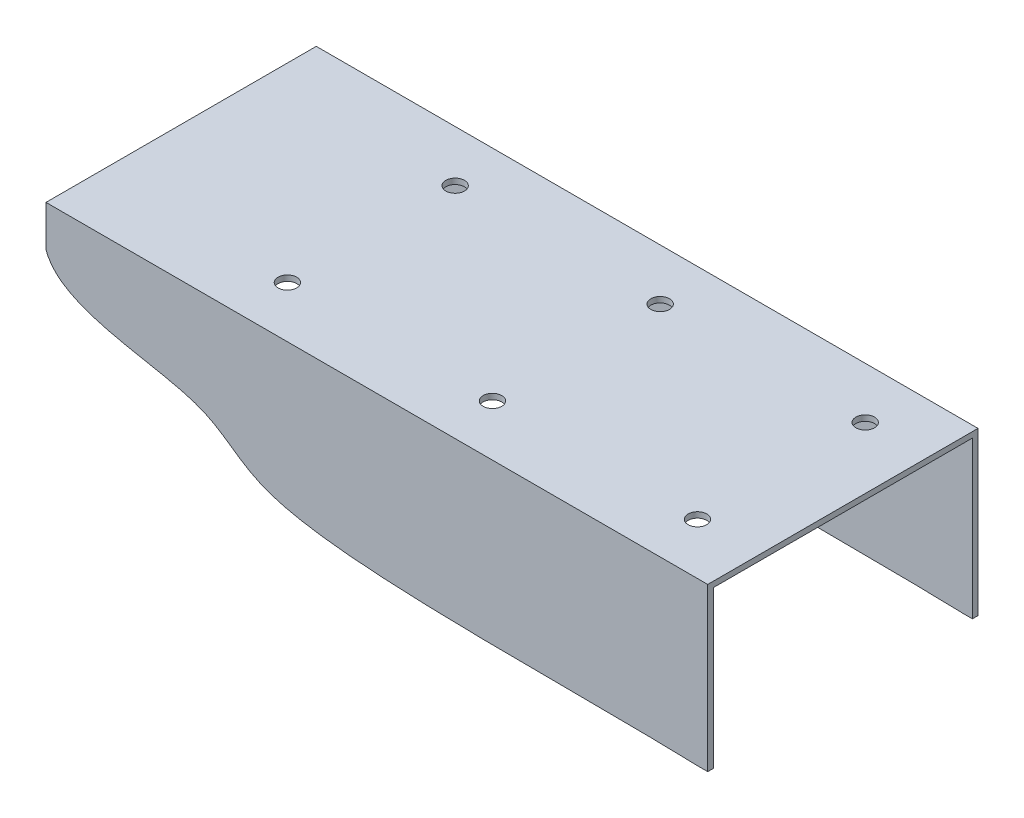
ISO-10303-21;
HEADER;
FILE_DESCRIPTION(('STEP AP214'),'2;1');
FILE_NAME('part.step','',(''),(''),'','','');
FILE_SCHEMA(('AUTOMOTIVE_DESIGN { 1 0 10303 214 1 1 1 1 }'));
ENDSEC;
DATA;
#1=APPLICATION_CONTEXT('core data for automotive mechanical design processes');
#2=APPLICATION_PROTOCOL_DEFINITION('international standard','automotive_design',2000,#1);
#3=PRODUCT_CONTEXT('',#1,'mechanical');
#4=PRODUCT('Part','Part','',(#3));
#5=PRODUCT_RELATED_PRODUCT_CATEGORY('part','',(#4));
#6=PRODUCT_DEFINITION_FORMATION('','',#4);
#7=PRODUCT_DEFINITION_CONTEXT('part definition',#1,'design');
#8=PRODUCT_DEFINITION('design','',#6,#7);
#9=PRODUCT_DEFINITION_SHAPE('','',#8);
#10=(LENGTH_UNIT() NAMED_UNIT(*) SI_UNIT(.MILLI.,.METRE.));
#11=(NAMED_UNIT(*) PLANE_ANGLE_UNIT() SI_UNIT($,.RADIAN.));
#12=(NAMED_UNIT(*) SI_UNIT($,.STERADIAN.) SOLID_ANGLE_UNIT());
#13=UNCERTAINTY_MEASURE_WITH_UNIT(LENGTH_MEASURE(1.E-05),#10,'distance_accuracy_value','');
#14=(GEOMETRIC_REPRESENTATION_CONTEXT(3) GLOBAL_UNCERTAINTY_ASSIGNED_CONTEXT((#13)) GLOBAL_UNIT_ASSIGNED_CONTEXT((#10,
#11,#12)) REPRESENTATION_CONTEXT('',''));
#15=CARTESIAN_POINT('',(0.,0.,0.));
#16=DIRECTION('',(0.,0.,1.));
#17=DIRECTION('',(1.,0.,0.));
#18=AXIS2_PLACEMENT_3D('',#15,#16,#17);
#19=CARTESIAN_POINT('',(355.,87.,-142.));
#20=DIRECTION('',(0.,0.,-1.));
#21=DIRECTION('',(0.,1.,0.));
#22=AXIS2_PLACEMENT_3D('',#19,#20,#21);
#23=PLANE('',#22);
#24=DIRECTION('',(0.,-1.,0.));
#25=VECTOR('',#24,1.);
#26=CARTESIAN_POINT('',(0.,87.,-142.));
#27=LINE('',#26,#25);
#28=CARTESIAN_POINT('',(0.,84.,-142.));
#29=VERTEX_POINT('',#28);
#30=CARTESIAN_POINT('',(0.,65.1240533198976,-142.));
#31=VERTEX_POINT('',#30);
#32=EDGE_CURVE('E131',#29,#31,#27,.T.);
#33=ORIENTED_EDGE('',*,*,#32,.T.);
#34=CARTESIAN_POINT('',(350.278484055666,0.,-142.));
#35=CARTESIAN_POINT('',(275.808566843251,2.45176160588045,-142.));
#36=CARTESIAN_POINT('',(115.548592718971,-4.57072039554063,-142.));
#37=CARTESIAN_POINT('',(88.8355878105045,42.6719648134176,-142.));
#38=CARTESIAN_POINT('',(7.9338411563133,41.7868873247122,-142.));
#39=CARTESIAN_POINT('',(0.,65.1240533198976,-142.));
#40=B_SPLINE_CURVE_WITH_KNOTS('',3,(#34,#35,#36,#37,#38,#39),.UNSPECIFIED.,.F.,.F.,(4,1,1,4),
(0.,0.462698867470422,0.667098704602418,1.),.UNSPECIFIED.);
#41=CARTESIAN_POINT('',(350.278484055666,0.,-142.));
#42=VERTEX_POINT('',#41);
#43=EDGE_CURVE('E57',#31,#42,#40,.F.);
#44=ORIENTED_EDGE('',*,*,#43,.T.);
#45=DIRECTION('',(-1.,0.,0.));
#46=VECTOR('',#45,1.);
#47=CARTESIAN_POINT('',(355.,0.,-142.));
#48=LINE('',#47,#46);
#49=CARTESIAN_POINT('',(355.,0.,-142.));
#50=VERTEX_POINT('',#49);
#51=EDGE_CURVE('E42',#50,#42,#48,.T.);
#52=ORIENTED_EDGE('',*,*,#51,.F.);
#53=DIRECTION('',(0.,-1.,0.));
#54=VECTOR('',#53,1.);
#55=CARTESIAN_POINT('',(355.,87.,-142.));
#56=LINE('',#55,#54);
#57=CARTESIAN_POINT('',(355.,84.,-142.));
#58=VERTEX_POINT('',#57);
#59=EDGE_CURVE('E143',#58,#50,#56,.T.);
#60=ORIENTED_EDGE('',*,*,#59,.F.);
#61=DIRECTION('',(-1.,0.,0.));
#62=VECTOR('',#61,1.);
#63=CARTESIAN_POINT('',(355.,84.,-142.));
#64=LINE('',#63,#62);
#65=EDGE_CURVE('E144',#58,#29,#64,.T.);
#66=ORIENTED_EDGE('',*,*,#65,.T.);
#67=EDGE_LOOP('',(#33,#44,#52,#60,#66));
#68=FACE_BOUND('',#67,.T.);
#69=ADVANCED_FACE('F34',(#68),#23,.F.);
#70=CARTESIAN_POINT('',(355.,0.,-145.));
#71=DIRECTION('',(0.,-1.,0.));
#72=DIRECTION('',(0.,0.,-1.));
#73=AXIS2_PLACEMENT_3D('',#70,#71,#72);
#74=PLANE('',#73);
#75=DIRECTION('',(0.,0.,1.));
#76=VECTOR('',#75,1.);
#77=CARTESIAN_POINT('',(350.278484055666,0.,-145.));
#78=LINE('',#77,#76);
#79=CARTESIAN_POINT('',(350.278484055666,0.,-145.));
#80=VERTEX_POINT('',#79);
#81=EDGE_CURVE('E251',#80,#42,#78,.T.);
#82=ORIENTED_EDGE('',*,*,#81,.F.);
#83=DIRECTION('',(-1.,0.,0.));
#84=VECTOR('',#83,1.);
#85=CARTESIAN_POINT('',(355.,0.,-145.));
#86=LINE('',#85,#84);
#87=CARTESIAN_POINT('',(355.,0.,-145.));
#88=VERTEX_POINT('',#87);
#89=EDGE_CURVE('E126',#88,#80,#86,.T.);
#90=ORIENTED_EDGE('',*,*,#89,.F.);
#91=DIRECTION('',(0.,0.,1.));
#92=VECTOR('',#91,1.);
#93=CARTESIAN_POINT('',(355.,0.,-145.));
#94=LINE('',#93,#92);
#95=EDGE_CURVE('E271',#88,#50,#94,.T.);
#96=ORIENTED_EDGE('',*,*,#95,.T.);
#97=ORIENTED_EDGE('',*,*,#51,.T.);
#98=EDGE_LOOP('',(#82,#90,#96,#97));
#99=FACE_BOUND('',#98,.T.);
#100=ADVANCED_FACE('F244',(#99),#74,.T.);
#101=CARTESIAN_POINT('',(355.,87.,-145.));
#102=DIRECTION('',(0.,0.,-1.));
#103=DIRECTION('',(0.,1.,0.));
#104=AXIS2_PLACEMENT_3D('',#101,#102,#103);
#105=PLANE('',#104);
#106=CARTESIAN_POINT('',(350.278484055666,0.,-145.));
#107=CARTESIAN_POINT('',(275.808566843251,2.45176160588045,-145.));
#108=CARTESIAN_POINT('',(115.548592718971,-4.57072039554063,-145.));
#109=CARTESIAN_POINT('',(88.8355878105045,42.6719648134176,-145.));
#110=CARTESIAN_POINT('',(7.9338411563133,41.7868873247122,-145.));
#111=CARTESIAN_POINT('',(0.,65.1240533198976,-145.));
#112=B_SPLINE_CURVE_WITH_KNOTS('',3,(#106,#107,#108,#109,#110,#111),.UNSPECIFIED.,.F.,.F.,(4,1,
1,4),(0.,0.462698867470422,0.667098704602418,1.),.UNSPECIFIED.);
#113=CARTESIAN_POINT('',(0.,65.1240533198976,-145.));
#114=VERTEX_POINT('',#113);
#115=EDGE_CURVE('E111',#80,#114,#112,.T.);
#116=ORIENTED_EDGE('',*,*,#115,.T.);
#117=DIRECTION('',(0.,-1.,0.));
#118=VECTOR('',#117,1.);
#119=CARTESIAN_POINT('',(0.,87.,-145.));
#120=LINE('',#119,#118);
#121=CARTESIAN_POINT('',(0.,87.,-145.));
#122=VERTEX_POINT('',#121);
#123=EDGE_CURVE('E123',#122,#114,#120,.T.);
#124=ORIENTED_EDGE('',*,*,#123,.F.);
#125=DIRECTION('',(-1.,0.,0.));
#126=VECTOR('',#125,1.);
#127=CARTESIAN_POINT('',(355.,87.,-145.));
#128=LINE('',#127,#126);
#129=CARTESIAN_POINT('',(355.,87.,-145.));
#130=VERTEX_POINT('',#129);
#131=EDGE_CURVE('E160',#130,#122,#128,.T.);
#132=ORIENTED_EDGE('',*,*,#131,.F.);
#133=DIRECTION('',(0.,-1.,0.));
#134=VECTOR('',#133,1.);
#135=CARTESIAN_POINT('',(355.,87.,-145.));
#136=LINE('',#135,#134);
#137=EDGE_CURVE('E273',#130,#88,#136,.T.);
#138=ORIENTED_EDGE('',*,*,#137,.T.);
#139=ORIENTED_EDGE('',*,*,#89,.T.);
#140=EDGE_LOOP('',(#116,#124,#132,#138,#139));
#141=FACE_BOUND('',#140,.T.);
#142=ADVANCED_FACE('F122',(#141),#105,.T.);
#143=CARTESIAN_POINT('',(355.,87.,0.));
#144=DIRECTION('',(0.,1.,0.));
#145=DIRECTION('',(0.,0.,1.));
#146=AXIS2_PLACEMENT_3D('',#143,#144,#145);
#147=PLANE('',#146);
#148=CARTESIAN_POINT('',(322.,87.,-27.5));
#149=DIRECTION('',(0.,1.,0.));
#150=DIRECTION('',(0.,0.,1.));
#151=AXIS2_PLACEMENT_3D('',#148,#149,#150);
#152=CIRCLE('',#151,5.00000000000005);
#153=CARTESIAN_POINT('',(322.,87.,-22.4999999999999));
#154=VERTEX_POINT('',#153);
#155=EDGE_CURVE('E192',#154,#154,#152,.T.);
#156=ORIENTED_EDGE('',*,*,#155,.F.);
#157=EDGE_LOOP('',(#156));
#158=FACE_BOUND('',#157,.T.);
#159=CARTESIAN_POINT('',(102.,87.,-27.4999999999985));
#160=DIRECTION('',(0.,1.,0.));
#161=DIRECTION('',(0.,0.,1.));
#162=AXIS2_PLACEMENT_3D('',#159,#160,#161);
#163=CIRCLE('',#162,5.00000000000005);
#164=CARTESIAN_POINT('',(102.,87.,-22.4999999999984));
#165=VERTEX_POINT('',#164);
#166=EDGE_CURVE('E182',#165,#165,#163,.T.);
#167=ORIENTED_EDGE('',*,*,#166,.F.);
#168=EDGE_LOOP('',(#167));
#169=FACE_BOUND('',#168,.T.);
#170=CARTESIAN_POINT('',(212.,87.,-27.4999999999992));
#171=DIRECTION('',(0.,1.,0.));
#172=DIRECTION('',(0.,0.,1.));
#173=AXIS2_PLACEMENT_3D('',#170,#171,#172);
#174=CIRCLE('',#173,5.00000000000005);
#175=CARTESIAN_POINT('',(212.,87.,-22.4999999999992));
#176=VERTEX_POINT('',#175);
#177=EDGE_CURVE('E179',#176,#176,#174,.T.);
#178=ORIENTED_EDGE('',*,*,#177,.F.);
#179=EDGE_LOOP('',(#178));
#180=FACE_BOUND('',#179,.T.);
#181=CARTESIAN_POINT('',(102.,87.,-117.499999999998));
#182=DIRECTION('',(0.,1.,0.));
#183=DIRECTION('',(0.,0.,1.));
#184=AXIS2_PLACEMENT_3D('',#181,#182,#183);
#185=CIRCLE('',#184,5.00000000000005);
#186=CARTESIAN_POINT('',(102.,87.,-112.499999999998));
#187=VERTEX_POINT('',#186);
#188=EDGE_CURVE('E176',#187,#187,#185,.T.);
#189=ORIENTED_EDGE('',*,*,#188,.F.);
#190=EDGE_LOOP('',(#189));
#191=FACE_BOUND('',#190,.T.);
#192=CARTESIAN_POINT('',(212.,87.,-117.499999999999));
#193=DIRECTION('',(0.,1.,0.));
#194=DIRECTION('',(0.,0.,1.));
#195=AXIS2_PLACEMENT_3D('',#192,#193,#194);
#196=CIRCLE('',#195,5.00000000000002);
#197=CARTESIAN_POINT('',(212.,87.,-112.499999999999));
#198=VERTEX_POINT('',#197);
#199=EDGE_CURVE('E172',#198,#198,#196,.T.);
#200=ORIENTED_EDGE('',*,*,#199,.F.);
#201=EDGE_LOOP('',(#200));
#202=FACE_BOUND('',#201,.T.);
#203=CARTESIAN_POINT('',(322.,87.,-117.5));
#204=DIRECTION('',(0.,1.,0.));
#205=DIRECTION('',(0.,0.,1.));
#206=AXIS2_PLACEMENT_3D('',#203,#204,#205);
#207=CIRCLE('',#206,5.00000000000005);
#208=CARTESIAN_POINT('',(322.,87.,-112.5));
#209=VERTEX_POINT('',#208);
#210=EDGE_CURVE('E168',#209,#209,#207,.T.);
#211=ORIENTED_EDGE('',*,*,#210,.F.);
#212=EDGE_LOOP('',(#211));
#213=FACE_BOUND('',#212,.T.);
#214=DIRECTION('',(0.,0.,-1.));
#215=VECTOR('',#214,1.);
#216=CARTESIAN_POINT('',(0.,87.,0.));
#217=LINE('',#216,#215);
#218=CARTESIAN_POINT('',(0.,87.,0.));
#219=VERTEX_POINT('',#218);
#220=EDGE_CURVE('E130',#219,#122,#217,.T.);
#221=ORIENTED_EDGE('',*,*,#220,.F.);
#222=DIRECTION('',(-1.,0.,0.));
#223=VECTOR('',#222,1.);
#224=CARTESIAN_POINT('',(355.,87.,0.));
#225=LINE('',#224,#223);
#226=CARTESIAN_POINT('',(355.,87.,0.));
#227=VERTEX_POINT('',#226);
#228=EDGE_CURVE('E157',#227,#219,#225,.T.);
#229=ORIENTED_EDGE('',*,*,#228,.F.);
#230=DIRECTION('',(0.,0.,-1.));
#231=VECTOR('',#230,1.);
#232=CARTESIAN_POINT('',(355.,87.,0.));
#233=LINE('',#232,#231);
#234=EDGE_CURVE('E275',#227,#130,#233,.T.);
#235=ORIENTED_EDGE('',*,*,#234,.T.);
#236=ORIENTED_EDGE('',*,*,#131,.T.);
#237=EDGE_LOOP('',(#221,#229,#235,#236));
#238=FACE_BOUND('',#237,.T.);
#239=ADVANCED_FACE('F238',(#158,#169,#180,#191,#202,#213,#238),#147,.T.);
#240=CARTESIAN_POINT('',(355.,0.,0.));
#241=DIRECTION('',(0.,0.,1.));
#242=DIRECTION('',(1.,0.,0.));
#243=AXIS2_PLACEMENT_3D('',#240,#241,#242);
#244=PLANE('',#243);
#245=CARTESIAN_POINT('',(350.278484055666,0.,0.));
#246=CARTESIAN_POINT('',(275.808566843251,2.45176160588045,0.));
#247=CARTESIAN_POINT('',(115.548592718971,-4.57072039554063,0.));
#248=CARTESIAN_POINT('',(88.8355878105045,42.6719648134176,0.));
#249=CARTESIAN_POINT('',(7.9338411563133,41.7868873247122,0.));
#250=CARTESIAN_POINT('',(0.,65.1240533198976,0.));
#251=B_SPLINE_CURVE_WITH_KNOTS('',3,(#245,#246,#247,#248,#249,#250),.UNSPECIFIED.,.F.,.F.,(4,1,
1,4),(0.,0.462698867470422,0.667098704602418,1.),.UNSPECIFIED.);
#252=CARTESIAN_POINT('',(350.278484055666,0.,0.));
#253=VERTEX_POINT('',#252);
#254=CARTESIAN_POINT('',(0.,65.1240533198976,0.));
#255=VERTEX_POINT('',#254);
#256=EDGE_CURVE('E49',#253,#255,#251,.T.);
#257=ORIENTED_EDGE('',*,*,#256,.F.);
#258=DIRECTION('',(-1.,0.,0.));
#259=VECTOR('',#258,1.);
#260=CARTESIAN_POINT('',(355.,0.,0.));
#261=LINE('',#260,#259);
#262=CARTESIAN_POINT('',(355.,0.,0.));
#263=VERTEX_POINT('',#262);
#264=EDGE_CURVE('E154',#263,#253,#261,.T.);
#265=ORIENTED_EDGE('',*,*,#264,.F.);
#266=DIRECTION('',(0.,1.,0.));
#267=VECTOR('',#266,1.);
#268=CARTESIAN_POINT('',(355.,0.,0.));
#269=LINE('',#268,#267);
#270=EDGE_CURVE('E278',#263,#227,#269,.T.);
#271=ORIENTED_EDGE('',*,*,#270,.T.);
#272=ORIENTED_EDGE('',*,*,#228,.T.);
#273=DIRECTION('',(0.,1.,0.));
#274=VECTOR('',#273,1.);
#275=CARTESIAN_POINT('',(0.,0.,0.));
#276=LINE('',#275,#274);
#277=EDGE_CURVE('E133',#255,#219,#276,.T.);
#278=ORIENTED_EDGE('',*,*,#277,.F.);
#279=EDGE_LOOP('',(#257,#265,#271,#272,#278));
#280=FACE_BOUND('',#279,.T.);
#281=ADVANCED_FACE('F234',(#280),#244,.T.);
#282=CARTESIAN_POINT('',(355.,0.,-3.));
#283=DIRECTION('',(0.,-1.,0.));
#284=DIRECTION('',(0.,0.,-1.));
#285=AXIS2_PLACEMENT_3D('',#282,#283,#284);
#286=PLANE('',#285);
#287=CARTESIAN_POINT('',(350.278484055666,0.,-3.));
#288=VERTEX_POINT('',#287);
#289=EDGE_CURVE('E117',#288,#253,#78,.T.);
#290=ORIENTED_EDGE('',*,*,#289,.F.);
#291=DIRECTION('',(-1.,0.,0.));
#292=VECTOR('',#291,1.);
#293=CARTESIAN_POINT('',(355.,0.,-3.));
#294=LINE('',#293,#292);
#295=CARTESIAN_POINT('',(355.,0.,-3.));
#296=VERTEX_POINT('',#295);
#297=EDGE_CURVE('E151',#296,#288,#294,.T.);
#298=ORIENTED_EDGE('',*,*,#297,.F.);
#299=DIRECTION('',(0.,0.,1.));
#300=VECTOR('',#299,1.);
#301=CARTESIAN_POINT('',(355.,0.,-3.));
#302=LINE('',#301,#300);
#303=EDGE_CURVE('E281',#296,#263,#302,.T.);
#304=ORIENTED_EDGE('',*,*,#303,.T.);
#305=ORIENTED_EDGE('',*,*,#264,.T.);
#306=EDGE_LOOP('',(#290,#298,#304,#305));
#307=FACE_BOUND('',#306,.T.);
#308=ADVANCED_FACE('F230',(#307),#286,.T.);
#309=CARTESIAN_POINT('',(355.,0.,-3.));
#310=DIRECTION('',(0.,0.,1.));
#311=DIRECTION('',(1.,0.,0.));
#312=AXIS2_PLACEMENT_3D('',#309,#310,#311);
#313=PLANE('',#312);
#314=ORIENTED_EDGE('',*,*,#297,.T.);
#315=CARTESIAN_POINT('',(350.278484055666,0.,-3.));
#316=CARTESIAN_POINT('',(275.808566843251,2.45176160588045,-3.));
#317=CARTESIAN_POINT('',(115.548592718971,-4.57072039554063,-3.));
#318=CARTESIAN_POINT('',(88.8355878105045,42.6719648134176,-3.));
#319=CARTESIAN_POINT('',(7.9338411563133,41.7868873247122,-3.));
#320=CARTESIAN_POINT('',(0.,65.1240533198976,-3.));
#321=B_SPLINE_CURVE_WITH_KNOTS('',3,(#315,#316,#317,#318,#319,#320),.UNSPECIFIED.,.F.,.F.,(4,1,
1,4),(0.,0.462698867470422,0.667098704602418,1.),.UNSPECIFIED.);
#322=CARTESIAN_POINT('',(0.,65.1240533198976,-3.));
#323=VERTEX_POINT('',#322);
#324=EDGE_CURVE('E255',#288,#323,#321,.T.);
#325=ORIENTED_EDGE('',*,*,#324,.T.);
#326=DIRECTION('',(0.,1.,0.));
#327=VECTOR('',#326,1.);
#328=CARTESIAN_POINT('',(0.,0.,-3.));
#329=LINE('',#328,#327);
#330=CARTESIAN_POINT('',(0.,84.,-3.));
#331=VERTEX_POINT('',#330);
#332=EDGE_CURVE('E139',#323,#331,#329,.T.);
#333=ORIENTED_EDGE('',*,*,#332,.T.);
#334=DIRECTION('',(-1.,0.,0.));
#335=VECTOR('',#334,1.);
#336=CARTESIAN_POINT('',(355.,84.,-3.));
#337=LINE('',#336,#335);
#338=CARTESIAN_POINT('',(355.,84.,-3.));
#339=VERTEX_POINT('',#338);
#340=EDGE_CURVE('E147',#339,#331,#337,.T.);
#341=ORIENTED_EDGE('',*,*,#340,.F.);
#342=DIRECTION('',(0.,1.,0.));
#343=VECTOR('',#342,1.);
#344=CARTESIAN_POINT('',(355.,0.,-3.));
#345=LINE('',#344,#343);
#346=EDGE_CURVE('E284',#296,#339,#345,.T.);
#347=ORIENTED_EDGE('',*,*,#346,.F.);
#348=EDGE_LOOP('',(#314,#325,#333,#341,#347));
#349=FACE_BOUND('',#348,.T.);
#350=ADVANCED_FACE('F226',(#349),#313,.F.);
#351=CARTESIAN_POINT('',(355.,84.,0.));
#352=DIRECTION('',(0.,1.,0.));
#353=DIRECTION('',(0.,0.,1.));
#354=AXIS2_PLACEMENT_3D('',#351,#352,#353);
#355=PLANE('',#354);
#356=CARTESIAN_POINT('',(322.,84.,-27.5));
#357=DIRECTION('',(0.,1.,0.));
#358=DIRECTION('',(0.,0.,1.));
#359=AXIS2_PLACEMENT_3D('',#356,#357,#358);
#360=CIRCLE('',#359,5.00000000000005);
#361=CARTESIAN_POINT('',(322.,84.,-22.4999999999999));
#362=VERTEX_POINT('',#361);
#363=EDGE_CURVE('E37',#362,#362,#360,.T.);
#364=ORIENTED_EDGE('',*,*,#363,.T.);
#365=EDGE_LOOP('',(#364));
#366=FACE_BOUND('',#365,.T.);
#367=CARTESIAN_POINT('',(102.,84.,-27.4999999999985));
#368=DIRECTION('',(0.,1.,0.));
#369=DIRECTION('',(0.,0.,1.));
#370=AXIS2_PLACEMENT_3D('',#367,#368,#369);
#371=CIRCLE('',#370,5.00000000000005);
#372=CARTESIAN_POINT('',(102.,84.,-22.4999999999984));
#373=VERTEX_POINT('',#372);
#374=EDGE_CURVE('E180',#373,#373,#371,.T.);
#375=ORIENTED_EDGE('',*,*,#374,.T.);
#376=EDGE_LOOP('',(#375));
#377=FACE_BOUND('',#376,.T.);
#378=CARTESIAN_POINT('',(212.,84.,-27.4999999999992));
#379=DIRECTION('',(0.,1.,0.));
#380=DIRECTION('',(0.,0.,1.));
#381=AXIS2_PLACEMENT_3D('',#378,#379,#380);
#382=CIRCLE('',#381,5.00000000000005);
#383=CARTESIAN_POINT('',(212.,84.,-22.4999999999992));
#384=VERTEX_POINT('',#383);
#385=EDGE_CURVE('E177',#384,#384,#382,.T.);
#386=ORIENTED_EDGE('',*,*,#385,.T.);
#387=EDGE_LOOP('',(#386));
#388=FACE_BOUND('',#387,.T.);
#389=CARTESIAN_POINT('',(102.,84.,-117.499999999998));
#390=DIRECTION('',(0.,1.,0.));
#391=DIRECTION('',(0.,0.,1.));
#392=AXIS2_PLACEMENT_3D('',#389,#390,#391);
#393=CIRCLE('',#392,5.00000000000005);
#394=CARTESIAN_POINT('',(102.,84.,-112.499999999998));
#395=VERTEX_POINT('',#394);
#396=EDGE_CURVE('E173',#395,#395,#393,.T.);
#397=ORIENTED_EDGE('',*,*,#396,.T.);
#398=EDGE_LOOP('',(#397));
#399=FACE_BOUND('',#398,.T.);
#400=CARTESIAN_POINT('',(212.,84.,-117.499999999999));
#401=DIRECTION('',(0.,1.,0.));
#402=DIRECTION('',(0.,0.,1.));
#403=AXIS2_PLACEMENT_3D('',#400,#401,#402);
#404=CIRCLE('',#403,5.00000000000002);
#405=CARTESIAN_POINT('',(212.,84.,-112.499999999999));
#406=VERTEX_POINT('',#405);
#407=EDGE_CURVE('E169',#406,#406,#404,.T.);
#408=ORIENTED_EDGE('',*,*,#407,.T.);
#409=EDGE_LOOP('',(#408));
#410=FACE_BOUND('',#409,.T.);
#411=CARTESIAN_POINT('',(322.,84.,-117.5));
#412=DIRECTION('',(0.,1.,0.));
#413=DIRECTION('',(0.,0.,1.));
#414=AXIS2_PLACEMENT_3D('',#411,#412,#413);
#415=CIRCLE('',#414,5.00000000000005);
#416=CARTESIAN_POINT('',(322.,84.,-112.5));
#417=VERTEX_POINT('',#416);
#418=EDGE_CURVE('E165',#417,#417,#415,.T.);
#419=ORIENTED_EDGE('',*,*,#418,.T.);
#420=EDGE_LOOP('',(#419));
#421=FACE_BOUND('',#420,.T.);
#422=DIRECTION('',(0.,0.,-1.));
#423=VECTOR('',#422,1.);
#424=CARTESIAN_POINT('',(0.,84.,0.));
#425=LINE('',#424,#423);
#426=EDGE_CURVE('E141',#331,#29,#425,.T.);
#427=ORIENTED_EDGE('',*,*,#426,.T.);
#428=ORIENTED_EDGE('',*,*,#65,.F.);
#429=DIRECTION('',(0.,0.,-1.));
#430=VECTOR('',#429,1.);
#431=CARTESIAN_POINT('',(355.,84.,0.));
#432=LINE('',#431,#430);
#433=EDGE_CURVE('E148',#339,#58,#432,.T.);
#434=ORIENTED_EDGE('',*,*,#433,.F.);
#435=ORIENTED_EDGE('',*,*,#340,.T.);
#436=EDGE_LOOP('',(#427,#428,#434,#435));
#437=FACE_BOUND('',#436,.T.);
#438=ADVANCED_FACE('F220',(#366,#377,#388,#399,#410,#421,#437),#355,.F.);
#439=CARTESIAN_POINT('',(355.,0.,0.));
#440=DIRECTION('',(-1.,0.,0.));
#441=DIRECTION('',(0.,0.,1.));
#442=AXIS2_PLACEMENT_3D('',#439,#440,#441);
#443=PLANE('',#442);
#444=ORIENTED_EDGE('',*,*,#59,.T.);
#445=ORIENTED_EDGE('',*,*,#95,.F.);
#446=ORIENTED_EDGE('',*,*,#137,.F.);
#447=ORIENTED_EDGE('',*,*,#234,.F.);
#448=ORIENTED_EDGE('',*,*,#270,.F.);
#449=ORIENTED_EDGE('',*,*,#303,.F.);
#450=ORIENTED_EDGE('',*,*,#346,.T.);
#451=ORIENTED_EDGE('',*,*,#433,.T.);
#452=EDGE_LOOP('',(#444,#445,#446,#447,#448,#449,#450,#451));
#453=FACE_BOUND('',#452,.T.);
#454=ADVANCED_FACE('F217',(#453),#443,.F.);
#455=CARTESIAN_POINT('',(0.,0.,0.));
#456=DIRECTION('',(-1.,0.,0.));
#457=DIRECTION('',(0.,0.,1.));
#458=AXIS2_PLACEMENT_3D('',#455,#456,#457);
#459=PLANE('',#458);
#460=DIRECTION('',(0.,0.,1.));
#461=VECTOR('',#460,1.);
#462=CARTESIAN_POINT('',(0.,65.1240533198976,-145.));
#463=LINE('',#462,#461);
#464=EDGE_CURVE('E11',#255,#323,#463,.F.);
#465=ORIENTED_EDGE('',*,*,#464,.F.);
#466=ORIENTED_EDGE('',*,*,#277,.T.);
#467=ORIENTED_EDGE('',*,*,#220,.T.);
#468=ORIENTED_EDGE('',*,*,#123,.T.);
#469=DIRECTION('',(0.,0.,1.));
#470=VECTOR('',#469,1.);
#471=CARTESIAN_POINT('',(0.,65.1240533198976,-145.));
#472=LINE('',#471,#470);
#473=EDGE_CURVE('E108',#114,#31,#472,.T.);
#474=ORIENTED_EDGE('',*,*,#473,.T.);
#475=ORIENTED_EDGE('',*,*,#32,.F.);
#476=ORIENTED_EDGE('',*,*,#426,.F.);
#477=ORIENTED_EDGE('',*,*,#332,.F.);
#478=EDGE_LOOP('',(#465,#466,#467,#468,#474,#475,#476,#477));
#479=FACE_BOUND('',#478,.T.);
#480=ADVANCED_FACE('F128',(#479),#459,.T.);
#481=DIRECTION('',(0.,0.,1.));
#482=VECTOR('',#481,1.);
#483=SURFACE_OF_LINEAR_EXTRUSION('',#112,#482);
#484=ORIENTED_EDGE('',*,*,#473,.F.);
#485=ORIENTED_EDGE('',*,*,#115,.F.);
#486=ORIENTED_EDGE('',*,*,#81,.T.);
#487=ORIENTED_EDGE('',*,*,#43,.F.);
#488=EDGE_LOOP('',(#484,#485,#486,#487));
#489=FACE_BOUND('',#488,.T.);
#490=ADVANCED_FACE('F110',(#489),#483,.F.);
#491=ORIENTED_EDGE('',*,*,#289,.T.);
#492=ORIENTED_EDGE('',*,*,#256,.T.);
#493=ORIENTED_EDGE('',*,*,#464,.T.);
#494=ORIENTED_EDGE('',*,*,#324,.F.);
#495=EDGE_LOOP('',(#491,#492,#493,#494));
#496=FACE_BOUND('',#495,.T.);
#497=ADVANCED_FACE('F214',(#496),#483,.F.);
#498=CARTESIAN_POINT('',(322.,77.,-117.5));
#499=DIRECTION('',(0.,1.,0.));
#500=DIRECTION('',(0.,0.,1.));
#501=AXIS2_PLACEMENT_3D('',#498,#499,#500);
#502=CYLINDRICAL_SURFACE('',#501,5.00000000000005);
#503=ORIENTED_EDGE('',*,*,#210,.T.);
#504=EDGE_LOOP('',(#503));
#505=FACE_BOUND('',#504,.T.);
#506=ORIENTED_EDGE('',*,*,#418,.F.);
#507=EDGE_LOOP('',(#506));
#508=FACE_BOUND('',#507,.T.);
#509=ADVANCED_FACE('F215',(#505,#508),#502,.F.);
#510=CARTESIAN_POINT('',(212.,77.,-117.499999999999));
#511=DIRECTION('',(0.,1.,0.));
#512=DIRECTION('',(0.,0.,1.));
#513=AXIS2_PLACEMENT_3D('',#510,#511,#512);
#514=CYLINDRICAL_SURFACE('',#513,5.00000000000002);
#515=ORIENTED_EDGE('',*,*,#199,.T.);
#516=EDGE_LOOP('',(#515));
#517=FACE_BOUND('',#516,.T.);
#518=ORIENTED_EDGE('',*,*,#407,.F.);
#519=EDGE_LOOP('',(#518));
#520=FACE_BOUND('',#519,.T.);
#521=ADVANCED_FACE('F304',(#517,#520),#514,.F.);
#522=CARTESIAN_POINT('',(102.,77.,-117.499999999998));
#523=DIRECTION('',(0.,1.,0.));
#524=DIRECTION('',(0.,0.,1.));
#525=AXIS2_PLACEMENT_3D('',#522,#523,#524);
#526=CYLINDRICAL_SURFACE('',#525,5.00000000000005);
#527=ORIENTED_EDGE('',*,*,#188,.T.);
#528=EDGE_LOOP('',(#527));
#529=FACE_BOUND('',#528,.T.);
#530=ORIENTED_EDGE('',*,*,#396,.F.);
#531=EDGE_LOOP('',(#530));
#532=FACE_BOUND('',#531,.T.);
#533=ADVANCED_FACE('F309',(#529,#532),#526,.F.);
#534=CARTESIAN_POINT('',(212.,77.,-27.4999999999992));
#535=DIRECTION('',(0.,1.,0.));
#536=DIRECTION('',(0.,0.,1.));
#537=AXIS2_PLACEMENT_3D('',#534,#535,#536);
#538=CYLINDRICAL_SURFACE('',#537,5.00000000000005);
#539=ORIENTED_EDGE('',*,*,#177,.T.);
#540=EDGE_LOOP('',(#539));
#541=FACE_BOUND('',#540,.T.);
#542=ORIENTED_EDGE('',*,*,#385,.F.);
#543=EDGE_LOOP('',(#542));
#544=FACE_BOUND('',#543,.T.);
#545=ADVANCED_FACE('F319',(#541,#544),#538,.F.);
#546=CARTESIAN_POINT('',(102.,77.,-27.4999999999985));
#547=DIRECTION('',(0.,1.,0.));
#548=DIRECTION('',(0.,0.,1.));
#549=AXIS2_PLACEMENT_3D('',#546,#547,#548);
#550=CYLINDRICAL_SURFACE('',#549,5.00000000000005);
#551=ORIENTED_EDGE('',*,*,#166,.T.);
#552=EDGE_LOOP('',(#551));
#553=FACE_BOUND('',#552,.T.);
#554=ORIENTED_EDGE('',*,*,#374,.F.);
#555=EDGE_LOOP('',(#554));
#556=FACE_BOUND('',#555,.T.);
#557=ADVANCED_FACE('F326',(#553,#556),#550,.F.);
#558=CARTESIAN_POINT('',(322.,77.,-27.5));
#559=DIRECTION('',(0.,1.,0.));
#560=DIRECTION('',(0.,0.,1.));
#561=AXIS2_PLACEMENT_3D('',#558,#559,#560);
#562=CYLINDRICAL_SURFACE('',#561,5.00000000000005);
#563=ORIENTED_EDGE('',*,*,#155,.T.);
#564=EDGE_LOOP('',(#563));
#565=FACE_BOUND('',#564,.T.);
#566=ORIENTED_EDGE('',*,*,#363,.F.);
#567=EDGE_LOOP('',(#566));
#568=FACE_BOUND('',#567,.T.);
#569=ADVANCED_FACE('F330',(#565,#568),#562,.F.);
#570=CLOSED_SHELL('',(#69,#100,#142,#239,#281,#308,#350,#438,#454,#480,#490,#497,#509,#521,#533,
#545,#557,#569));
#571=MANIFOLD_SOLID_BREP('B2',#570);
#572=ADVANCED_BREP_SHAPE_REPRESENTATION('',(#18,#571),#14);
#573=SHAPE_DEFINITION_REPRESENTATION(#9,#572);
ENDSEC;
END-ISO-10303-21;
